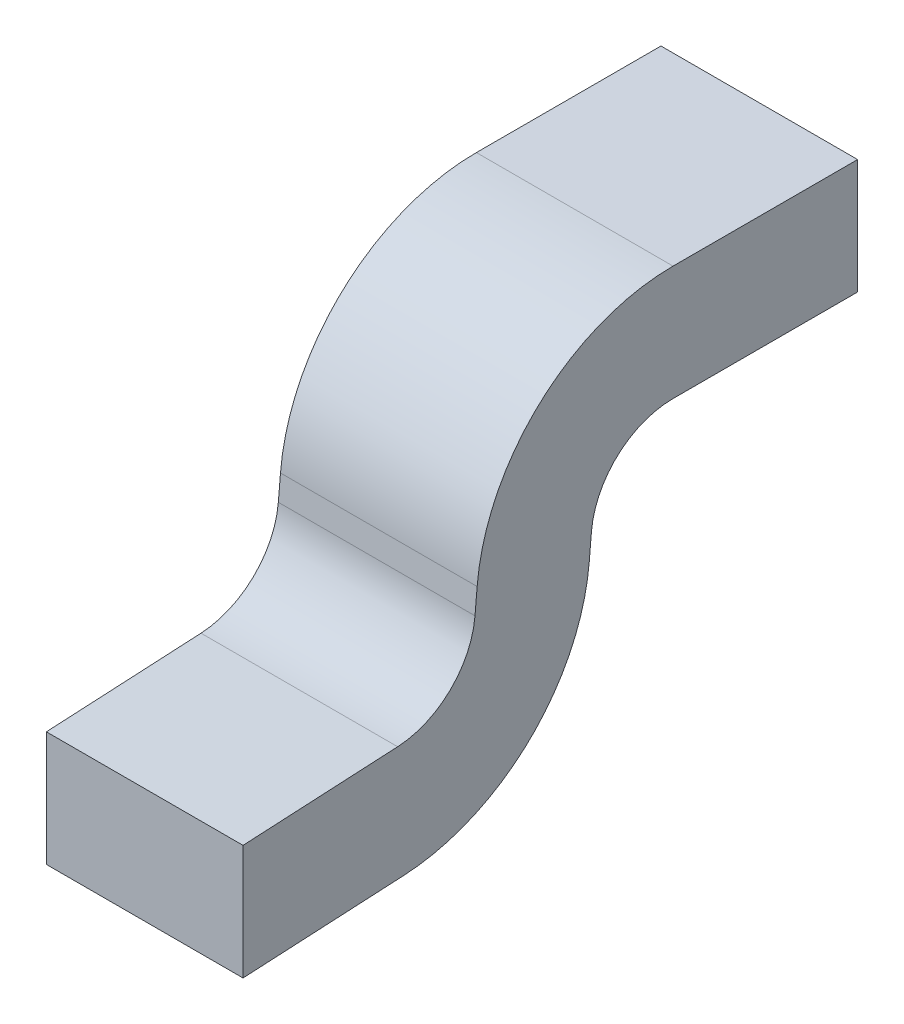
ISO-10303-21;
HEADER;
FILE_DESCRIPTION(('STEP AP214'),'2;1');
FILE_NAME('part.step','',(''),(''),'','','');
FILE_SCHEMA(('AUTOMOTIVE_DESIGN { 1 0 10303 214 1 1 1 1 }'));
ENDSEC;
DATA;
#1=APPLICATION_CONTEXT('core data for automotive mechanical design processes');
#2=APPLICATION_PROTOCOL_DEFINITION('international standard','automotive_design',2000,#1);
#3=PRODUCT_CONTEXT('',#1,'mechanical');
#4=PRODUCT('Part','Part','',(#3));
#5=PRODUCT_RELATED_PRODUCT_CATEGORY('part','',(#4));
#6=PRODUCT_DEFINITION_FORMATION('','',#4);
#7=PRODUCT_DEFINITION_CONTEXT('part definition',#1,'design');
#8=PRODUCT_DEFINITION('design','',#6,#7);
#9=PRODUCT_DEFINITION_SHAPE('','',#8);
#10=(LENGTH_UNIT() NAMED_UNIT(*) SI_UNIT(.MILLI.,.METRE.));
#11=(NAMED_UNIT(*) PLANE_ANGLE_UNIT() SI_UNIT($,.RADIAN.));
#12=(NAMED_UNIT(*) SI_UNIT($,.STERADIAN.) SOLID_ANGLE_UNIT());
#13=UNCERTAINTY_MEASURE_WITH_UNIT(LENGTH_MEASURE(1.E-05),#10,'distance_accuracy_value','');
#14=(GEOMETRIC_REPRESENTATION_CONTEXT(3) GLOBAL_UNCERTAINTY_ASSIGNED_CONTEXT((#13)) GLOBAL_UNIT_ASSIGNED_CONTEXT((#10,
#11,#12)) REPRESENTATION_CONTEXT('',''));
#15=CARTESIAN_POINT('',(0.,0.,0.));
#16=DIRECTION('',(0.,0.,1.));
#17=DIRECTION('',(1.,0.,0.));
#18=AXIS2_PLACEMENT_3D('',#15,#16,#17);
#19=CARTESIAN_POINT('',(0.1524,0.,0.));
#20=DIRECTION('',(1.,0.,0.));
#21=DIRECTION('',(0.,0.,-1.));
#22=AXIS2_PLACEMENT_3D('',#19,#20,#21);
#23=PLANE('',#22);
#24=DIRECTION('',(0.,-0.0523359562429177,0.998629534754575));
#25=VECTOR('',#24,1.);
#26=CARTESIAN_POINT('',(0.1524,-0.05761957494792,0.18352022672));
#27=LINE('',#26,#25);
#28=CARTESIAN_POINT('',(0.1524,-0.0759559968815696,0.5334));
#29=VERTEX_POINT('',#28);
#30=CARTESIAN_POINT('',(0.1524,-0.0633974339373912,0.293768343860575));
#31=VERTEX_POINT('',#30);
#32=EDGE_CURVE('E112',#29,#31,#27,.F.);
#33=ORIENTED_EDGE('',*,*,#32,.F.);
#34=DIRECTION('',(0.,1.,0.));
#35=VECTOR('',#34,1.);
#36=CARTESIAN_POINT('',(0.1524,-0.254,0.5334));
#37=LINE('',#36,#35);
#38=CARTESIAN_POINT('',(0.1524,-0.254,0.5334));
#39=VERTEX_POINT('',#38);
#40=EDGE_CURVE('E103',#29,#39,#37,.F.);
#41=ORIENTED_EDGE('',*,*,#40,.T.);
#42=DIRECTION('',(0.,0.0523359562429177,-0.998629534754575));
#43=VECTOR('',#42,1.);
#44=CARTESIAN_POINT('',(0.1524,-0.254,0.5334));
#45=LINE('',#44,#43);
#46=CARTESIAN_POINT('',(0.1524,-0.240953765216766,0.284463010840585));
#47=VERTEX_POINT('',#46);
#48=EDGE_CURVE('E95',#47,#39,#45,.F.);
#49=ORIENTED_EDGE('',*,*,#48,.F.);
#50=CARTESIAN_POINT('',(0.1524,0.06342851697644,0.300415010303));
#51=DIRECTION('',(-1.,0.,0.));
#52=DIRECTION('',(0.,0.,1.));
#53=AXIS2_PLACEMENT_3D('',#50,#51,#52);
#54=CIRCLE('',#53,0.3048);
#55=CARTESIAN_POINT('',(0.1524,0.0368634465869779,-0.00322513367484743));
#56=VERTEX_POINT('',#55);
#57=EDGE_CURVE('E20',#56,#47,#54,.T.);
#58=ORIENTED_EDGE('',*,*,#57,.F.);
#59=DIRECTION('',(0.,0.996194698091747,-0.0871557427476379));
#60=VECTOR('',#59,1.);
#61=CARTESIAN_POINT('',(0.1524,-0.227086903642,0.01986752970388));
#62=LINE('',#61,#60);
#63=CARTESIAN_POINT('',(0.1524,0.0745687793289503,-0.00652392284429511));
#64=VERTEX_POINT('',#63);
#65=EDGE_CURVE('E149',#64,#56,#62,.F.);
#66=ORIENTED_EDGE('',*,*,#65,.F.);
#67=CARTESIAN_POINT('',(0.1524,0.0635,-0.133040649502));
#68=DIRECTION('',(1.,0.,0.));
#69=DIRECTION('',(0.,0.,-1.));
#70=AXIS2_PLACEMENT_3D('',#67,#68,#69);
#71=CIRCLE('',#70,0.127);
#72=CARTESIAN_POINT('',(0.1524,0.1905,-0.133040649502));
#73=VERTEX_POINT('',#72);
#74=EDGE_CURVE('E146',#64,#73,#71,.F.);
#75=ORIENTED_EDGE('',*,*,#74,.T.);
#76=DIRECTION('',(0.,0.,-1.));
#77=VECTOR('',#76,1.);
#78=CARTESIAN_POINT('',(0.1524,0.1905,-0.01666659040169));
#79=LINE('',#78,#77);
#80=CARTESIAN_POINT('',(0.1524,0.1905,-0.4191));
#81=VERTEX_POINT('',#80);
#82=EDGE_CURVE('E144',#81,#73,#79,.F.);
#83=ORIENTED_EDGE('',*,*,#82,.F.);
#84=DIRECTION('',(0.,1.,0.));
#85=VECTOR('',#84,1.);
#86=CARTESIAN_POINT('',(0.1524,0.1905,-0.4191));
#87=LINE('',#86,#85);
#88=CARTESIAN_POINT('',(0.1524,0.3683,-0.4191));
#89=VERTEX_POINT('',#88);
#90=EDGE_CURVE('E138',#89,#81,#87,.F.);
#91=ORIENTED_EDGE('',*,*,#90,.F.);
#92=DIRECTION('',(0.,0.,1.));
#93=VECTOR('',#92,1.);
#94=CARTESIAN_POINT('',(0.1524,0.3683,-0.4191));
#95=LINE('',#94,#93);
#96=CARTESIAN_POINT('',(0.1524,0.3683,-0.133040649502));
#97=VERTEX_POINT('',#96);
#98=EDGE_CURVE('E131',#97,#89,#95,.F.);
#99=ORIENTED_EDGE('',*,*,#98,.F.);
#100=CARTESIAN_POINT('',(0.1524,0.0635,-0.133040649502));
#101=DIRECTION('',(-1.,0.,0.));
#102=DIRECTION('',(0.,0.,1.));
#103=AXIS2_PLACEMENT_3D('',#100,#101,#102);
#104=CIRCLE('',#103,0.3048);
#105=CARTESIAN_POINT('',(0.1524,0.0900650703895345,0.170599494476747));
#106=VERTEX_POINT('',#105);
#107=EDGE_CURVE('E172',#106,#97,#104,.T.);
#108=ORIENTED_EDGE('',*,*,#107,.F.);
#109=DIRECTION('',(0.,-0.996194698091747,0.0871557427476379));
#110=VECTOR('',#109,1.);
#111=CARTESIAN_POINT('',(0.1524,0.01549629106053,0.177123417321));
#112=LINE('',#111,#110);
#113=CARTESIAN_POINT('',(0.1524,0.0523597376475014,0.173898283645747));
#114=VERTEX_POINT('',#113);
#115=EDGE_CURVE('E127',#114,#106,#112,.F.);
#116=ORIENTED_EDGE('',*,*,#115,.F.);
#117=CARTESIAN_POINT('',(0.1524,0.06342851697644,0.300415010303));
#118=DIRECTION('',(1.,0.,0.));
#119=DIRECTION('',(0.,0.,-1.));
#120=AXIS2_PLACEMENT_3D('',#117,#118,#119);
#121=CIRCLE('',#120,0.127);
#122=EDGE_CURVE('E117',#114,#31,#121,.F.);
#123=ORIENTED_EDGE('',*,*,#122,.T.);
#124=EDGE_LOOP('',(#33,#41,#49,#58,#66,#75,#83,#91,#99,#108,#116,#123));
#125=FACE_BOUND('',#124,.T.);
#126=ADVANCED_FACE('F17',(#125),#23,.T.);
#127=CARTESIAN_POINT('',(0.18288,-0.254,0.5334));
#128=DIRECTION('',(0.,0.,-1.));
#129=DIRECTION('',(-1.,0.,0.));
#130=AXIS2_PLACEMENT_3D('',#127,#128,#129);
#131=PLANE('',#130);
#132=ORIENTED_EDGE('',*,*,#40,.F.);
#133=DIRECTION('',(1.,0.,0.));
#134=VECTOR('',#133,1.);
#135=CARTESIAN_POINT('',(-0.1524,-0.0759559968815696,0.533400000000001));
#136=LINE('',#135,#134);
#137=CARTESIAN_POINT('',(-0.1524,-0.0759559968815765,0.5334));
#138=VERTEX_POINT('',#137);
#139=EDGE_CURVE('E107',#138,#29,#136,.T.);
#140=ORIENTED_EDGE('',*,*,#139,.F.);
#141=DIRECTION('',(0.,1.,0.));
#142=VECTOR('',#141,1.);
#143=CARTESIAN_POINT('',(-0.1524,0.,0.5334));
#144=LINE('',#143,#142);
#145=CARTESIAN_POINT('',(-0.1524,-0.254,0.5334));
#146=VERTEX_POINT('',#145);
#147=EDGE_CURVE('E114',#138,#146,#144,.F.);
#148=ORIENTED_EDGE('',*,*,#147,.T.);
#149=DIRECTION('',(1.,0.,0.));
#150=VECTOR('',#149,1.);
#151=CARTESIAN_POINT('',(-0.1524,-0.254,0.5334));
#152=LINE('',#151,#150);
#153=EDGE_CURVE('E108',#39,#146,#152,.F.);
#154=ORIENTED_EDGE('',*,*,#153,.F.);
#155=EDGE_LOOP('',(#132,#140,#148,#154));
#156=FACE_BOUND('',#155,.T.);
#157=ADVANCED_FACE('F105',(#156),#131,.F.);
#158=CARTESIAN_POINT('',(-0.1524,-0.254,0.5334));
#159=DIRECTION('',(0.,-0.998629534754575,-0.0523359562429177));
#160=DIRECTION('',(0.,0.0523359562429177,-0.998629534754575));
#161=AXIS2_PLACEMENT_3D('',#158,#159,#160);
#162=PLANE('',#161);
#163=ORIENTED_EDGE('',*,*,#48,.T.);
#164=ORIENTED_EDGE('',*,*,#153,.T.);
#165=DIRECTION('',(0.,0.0523359562420249,-0.998629534754622));
#166=VECTOR('',#165,1.);
#167=CARTESIAN_POINT('',(-0.1524,-0.254,0.5334));
#168=LINE('',#167,#166);
#169=CARTESIAN_POINT('',(-0.1524,-0.240953765216884,0.284463010840715));
#170=VERTEX_POINT('',#169);
#171=EDGE_CURVE('E170',#146,#170,#168,.T.);
#172=ORIENTED_EDGE('',*,*,#171,.T.);
#173=DIRECTION('',(-1.,0.,0.));
#174=VECTOR('',#173,1.);
#175=CARTESIAN_POINT('',(-0.1524,-0.240953765216799,0.284463010841011));
#176=LINE('',#175,#174);
#177=EDGE_CURVE('E185',#47,#170,#176,.T.);
#178=ORIENTED_EDGE('',*,*,#177,.F.);
#179=EDGE_LOOP('',(#163,#164,#172,#178));
#180=FACE_BOUND('',#179,.T.);
#181=ADVANCED_FACE('F191',(#180),#162,.T.);
#182=CARTESIAN_POINT('',(-0.1524,0.06342851697644,0.300415010303));
#183=DIRECTION('',(-1.,0.,0.));
#184=DIRECTION('',(0.,0.,1.));
#185=AXIS2_PLACEMENT_3D('',#182,#183,#184);
#186=CYLINDRICAL_SURFACE('',#185,0.3048);
#187=CARTESIAN_POINT('',(-0.1524,0.06342851697644,0.300415010303));
#188=DIRECTION('',(-1.,0.,0.));
#189=DIRECTION('',(0.,0.,1.));
#190=AXIS2_PLACEMENT_3D('',#187,#188,#189);
#191=CIRCLE('',#190,0.3048);
#192=CARTESIAN_POINT('',(-0.1524,0.0368634465869818,-0.0032251336748518));
#193=VERTEX_POINT('',#192);
#194=EDGE_CURVE('E168',#170,#193,#191,.F.);
#195=ORIENTED_EDGE('',*,*,#194,.T.);
#196=DIRECTION('',(1.,0.,0.));
#197=VECTOR('',#196,1.);
#198=CARTESIAN_POINT('',(-0.1524,0.0368634465869507,-0.00322513367484505));
#199=LINE('',#198,#197);
#200=EDGE_CURVE('E152',#56,#193,#199,.F.);
#201=ORIENTED_EDGE('',*,*,#200,.F.);
#202=ORIENTED_EDGE('',*,*,#57,.T.);
#203=ORIENTED_EDGE('',*,*,#177,.T.);
#204=EDGE_LOOP('',(#195,#201,#202,#203));
#205=FACE_BOUND('',#204,.T.);
#206=ADVANCED_FACE('F245',(#205),#186,.T.);
#207=CARTESIAN_POINT('',(-0.1524,-0.227086903642,0.01986752970388));
#208=DIRECTION('',(0.,-0.0871557427476379,-0.996194698091747));
#209=DIRECTION('',(0.,0.996194698091747,-0.0871557427476379));
#210=AXIS2_PLACEMENT_3D('',#207,#208,#209);
#211=PLANE('',#210);
#212=DIRECTION('',(1.,0.,0.));
#213=VECTOR('',#212,1.);
#214=CARTESIAN_POINT('',(-0.1524,0.0745687793289414,-0.00652392284434736));
#215=LINE('',#214,#213);
#216=CARTESIAN_POINT('',(-0.1524,0.0745687793289482,-0.00652392284429839));
#217=VERTEX_POINT('',#216);
#218=EDGE_CURVE('E151',#217,#64,#215,.T.);
#219=ORIENTED_EDGE('',*,*,#218,.T.);
#220=ORIENTED_EDGE('',*,*,#65,.T.);
#221=ORIENTED_EDGE('',*,*,#200,.T.);
#222=DIRECTION('',(0.,0.99619469809175,-0.0871557427476098));
#223=VECTOR('',#222,1.);
#224=CARTESIAN_POINT('',(-0.1524,0.03686344658695,-0.003225133674853));
#225=LINE('',#224,#223);
#226=EDGE_CURVE('E167',#193,#217,#225,.T.);
#227=ORIENTED_EDGE('',*,*,#226,.T.);
#228=EDGE_LOOP('',(#219,#220,#221,#227));
#229=FACE_BOUND('',#228,.T.);
#230=ADVANCED_FACE('F244',(#229),#211,.T.);
#231=CARTESIAN_POINT('',(-0.1524,0.0635,-0.133040649502));
#232=DIRECTION('',(1.,0.,0.));
#233=DIRECTION('',(0.,0.,-1.));
#234=AXIS2_PLACEMENT_3D('',#231,#232,#233);
#235=CYLINDRICAL_SURFACE('',#234,0.127);
#236=ORIENTED_EDGE('',*,*,#218,.F.);
#237=CARTESIAN_POINT('',(-0.1524,0.0635,-0.133040649502));
#238=DIRECTION('',(1.,0.,0.));
#239=DIRECTION('',(0.,0.,-1.));
#240=AXIS2_PLACEMENT_3D('',#237,#238,#239);
#241=CIRCLE('',#240,0.127);
#242=CARTESIAN_POINT('',(-0.1524,0.1905,-0.133040649502));
#243=VERTEX_POINT('',#242);
#244=EDGE_CURVE('E163',#217,#243,#241,.F.);
#245=ORIENTED_EDGE('',*,*,#244,.T.);
#246=DIRECTION('',(1.,0.,0.));
#247=VECTOR('',#246,1.);
#248=CARTESIAN_POINT('',(-0.1524,0.1905,-0.133040649502));
#249=LINE('',#248,#247);
#250=EDGE_CURVE('E141',#73,#243,#249,.F.);
#251=ORIENTED_EDGE('',*,*,#250,.F.);
#252=ORIENTED_EDGE('',*,*,#74,.F.);
#253=EDGE_LOOP('',(#236,#245,#251,#252));
#254=FACE_BOUND('',#253,.T.);
#255=ADVANCED_FACE('F253',(#254),#235,.F.);
#256=CARTESIAN_POINT('',(-0.1524,0.1905,-0.01666659040169));
#257=DIRECTION('',(0.,-1.,0.));
#258=DIRECTION('',(0.,0.,-1.));
#259=AXIS2_PLACEMENT_3D('',#256,#257,#258);
#260=PLANE('',#259);
#261=ORIENTED_EDGE('',*,*,#250,.T.);
#262=DIRECTION('',(0.,0.,-1.));
#263=VECTOR('',#262,1.);
#264=CARTESIAN_POINT('',(-0.1524,0.1905,0.));
#265=LINE('',#264,#263);
#266=CARTESIAN_POINT('',(-0.1524,0.1905,-0.4191));
#267=VERTEX_POINT('',#266);
#268=EDGE_CURVE('E166',#243,#267,#265,.T.);
#269=ORIENTED_EDGE('',*,*,#268,.T.);
#270=DIRECTION('',(-1.,0.,0.));
#271=VECTOR('',#270,1.);
#272=CARTESIAN_POINT('',(-0.1524,0.1905,-0.4191));
#273=LINE('',#272,#271);
#274=EDGE_CURVE('E135',#81,#267,#273,.T.);
#275=ORIENTED_EDGE('',*,*,#274,.F.);
#276=ORIENTED_EDGE('',*,*,#82,.T.);
#277=EDGE_LOOP('',(#261,#269,#275,#276));
#278=FACE_BOUND('',#277,.T.);
#279=ADVANCED_FACE('F234',(#278),#260,.T.);
#280=CARTESIAN_POINT('',(-0.1524,0.1905,-0.4191));
#281=DIRECTION('',(0.,0.,-1.));
#282=DIRECTION('',(-1.,0.,0.));
#283=AXIS2_PLACEMENT_3D('',#280,#281,#282);
#284=PLANE('',#283);
#285=ORIENTED_EDGE('',*,*,#274,.T.);
#286=DIRECTION('',(0.,1.,0.));
#287=VECTOR('',#286,1.);
#288=CARTESIAN_POINT('',(-0.1524,0.,-0.4191));
#289=LINE('',#288,#287);
#290=CARTESIAN_POINT('',(-0.1524,0.3683,-0.4191));
#291=VERTEX_POINT('',#290);
#292=EDGE_CURVE('E213',#267,#291,#289,.T.);
#293=ORIENTED_EDGE('',*,*,#292,.T.);
#294=DIRECTION('',(1.,0.,0.));
#295=VECTOR('',#294,1.);
#296=CARTESIAN_POINT('',(-0.1524,0.3683,-0.4191));
#297=LINE('',#296,#295);
#298=EDGE_CURVE('E134',#89,#291,#297,.F.);
#299=ORIENTED_EDGE('',*,*,#298,.F.);
#300=ORIENTED_EDGE('',*,*,#90,.T.);
#301=EDGE_LOOP('',(#285,#293,#299,#300));
#302=FACE_BOUND('',#301,.T.);
#303=ADVANCED_FACE('F223',(#302),#284,.T.);
#304=CARTESIAN_POINT('',(-0.1524,0.3683,-0.4191));
#305=DIRECTION('',(0.,1.,0.));
#306=DIRECTION('',(0.,0.,1.));
#307=AXIS2_PLACEMENT_3D('',#304,#305,#306);
#308=PLANE('',#307);
#309=ORIENTED_EDGE('',*,*,#298,.T.);
#310=DIRECTION('',(0.,0.,-1.));
#311=VECTOR('',#310,1.);
#312=CARTESIAN_POINT('',(-0.1524,0.3683,0.));
#313=LINE('',#312,#311);
#314=CARTESIAN_POINT('',(-0.1524,0.3683,-0.133040649502));
#315=VERTEX_POINT('',#314);
#316=EDGE_CURVE('E162',#291,#315,#313,.F.);
#317=ORIENTED_EDGE('',*,*,#316,.T.);
#318=DIRECTION('',(-1.,0.,0.));
#319=VECTOR('',#318,1.);
#320=CARTESIAN_POINT('',(-0.1524,0.3683,-0.133040649502));
#321=LINE('',#320,#319);
#322=EDGE_CURVE('E130',#97,#315,#321,.T.);
#323=ORIENTED_EDGE('',*,*,#322,.F.);
#324=ORIENTED_EDGE('',*,*,#98,.T.);
#325=EDGE_LOOP('',(#309,#317,#323,#324));
#326=FACE_BOUND('',#325,.T.);
#327=ADVANCED_FACE('F274',(#326),#308,.T.);
#328=CARTESIAN_POINT('',(-0.1524,0.0635,-0.133040649502));
#329=DIRECTION('',(-1.,0.,0.));
#330=DIRECTION('',(0.,0.,1.));
#331=AXIS2_PLACEMENT_3D('',#328,#329,#330);
#332=CYLINDRICAL_SURFACE('',#331,0.3048);
#333=CARTESIAN_POINT('',(-0.1524,0.0635,-0.133040649502));
#334=DIRECTION('',(-1.,0.,0.));
#335=DIRECTION('',(0.,0.,1.));
#336=AXIS2_PLACEMENT_3D('',#333,#334,#335);
#337=CIRCLE('',#336,0.3048);
#338=CARTESIAN_POINT('',(-0.1524,0.0900650703919145,0.170599494476164));
#339=VERTEX_POINT('',#338);
#340=EDGE_CURVE('E159',#315,#339,#337,.F.);
#341=ORIENTED_EDGE('',*,*,#340,.T.);
#342=DIRECTION('',(1.,0.,0.));
#343=VECTOR('',#342,1.);
#344=CARTESIAN_POINT('',(-0.1524,0.0900650703895552,0.170599494476746));
#345=LINE('',#344,#343);
#346=EDGE_CURVE('E129',#106,#339,#345,.F.);
#347=ORIENTED_EDGE('',*,*,#346,.F.);
#348=ORIENTED_EDGE('',*,*,#107,.T.);
#349=ORIENTED_EDGE('',*,*,#322,.T.);
#350=EDGE_LOOP('',(#341,#347,#348,#349));
#351=FACE_BOUND('',#350,.T.);
#352=ADVANCED_FACE('F270',(#351),#332,.T.);
#353=CARTESIAN_POINT('',(-0.1524,0.01549629106053,0.177123417321));
#354=DIRECTION('',(0.,0.0871557427476379,0.996194698091747));
#355=DIRECTION('',(0.,-0.996194698091747,0.0871557427476379));
#356=AXIS2_PLACEMENT_3D('',#353,#354,#355);
#357=PLANE('',#356);
#358=ORIENTED_EDGE('',*,*,#346,.T.);
#359=DIRECTION('',(0.,-0.996194698090362,0.0871557427634692));
#360=VECTOR('',#359,1.);
#361=CARTESIAN_POINT('',(-0.1524,0.09006507038949,0.170599494476));
#362=LINE('',#361,#360);
#363=CARTESIAN_POINT('',(-0.1524,0.0523597376464897,0.173898283645762));
#364=VERTEX_POINT('',#363);
#365=EDGE_CURVE('E158',#339,#364,#362,.T.);
#366=ORIENTED_EDGE('',*,*,#365,.T.);
#367=DIRECTION('',(1.,0.,0.));
#368=VECTOR('',#367,1.);
#369=CARTESIAN_POINT('',(-0.1524,0.0523597376474434,0.173898283645352));
#370=LINE('',#369,#368);
#371=EDGE_CURVE('E120',#364,#114,#370,.T.);
#372=ORIENTED_EDGE('',*,*,#371,.T.);
#373=ORIENTED_EDGE('',*,*,#115,.T.);
#374=EDGE_LOOP('',(#358,#366,#372,#373));
#375=FACE_BOUND('',#374,.T.);
#376=ADVANCED_FACE('F266',(#375),#357,.T.);
#377=CARTESIAN_POINT('',(-0.1524,0.06342851697644,0.300415010303));
#378=DIRECTION('',(1.,0.,0.));
#379=DIRECTION('',(0.,0.,-1.));
#380=AXIS2_PLACEMENT_3D('',#377,#378,#379);
#381=CYLINDRICAL_SURFACE('',#380,0.127);
#382=ORIENTED_EDGE('',*,*,#371,.F.);
#383=CARTESIAN_POINT('',(-0.1524,0.06342851697644,0.300415010303));
#384=DIRECTION('',(1.,0.,0.));
#385=DIRECTION('',(0.,0.,-1.));
#386=AXIS2_PLACEMENT_3D('',#383,#384,#385);
#387=CIRCLE('',#386,0.127);
#388=CARTESIAN_POINT('',(-0.1524,-0.063397433937379,0.293768343860566));
#389=VERTEX_POINT('',#388);
#390=EDGE_CURVE('E26',#364,#389,#387,.F.);
#391=ORIENTED_EDGE('',*,*,#390,.T.);
#392=DIRECTION('',(1.,0.,0.));
#393=VECTOR('',#392,1.);
#394=CARTESIAN_POINT('',(-0.1524,-0.0633974339374134,0.293768343860999));
#395=LINE('',#394,#393);
#396=EDGE_CURVE('E34',#31,#389,#395,.F.);
#397=ORIENTED_EDGE('',*,*,#396,.F.);
#398=ORIENTED_EDGE('',*,*,#122,.F.);
#399=EDGE_LOOP('',(#382,#391,#397,#398));
#400=FACE_BOUND('',#399,.T.);
#401=ADVANCED_FACE('F261',(#400),#381,.F.);
#402=CARTESIAN_POINT('',(-0.1524,-0.05761957494792,0.18352022672));
#403=DIRECTION('',(0.,0.998629534754575,0.0523359562429177));
#404=DIRECTION('',(0.,-0.0523359562429177,0.998629534754575));
#405=AXIS2_PLACEMENT_3D('',#402,#403,#404);
#406=PLANE('',#405);
#407=DIRECTION('',(0.,-0.0523359562430588,0.998629534754568));
#408=VECTOR('',#407,1.);
#409=CARTESIAN_POINT('',(-0.1524,-0.06339743393739,0.293768343861));
#410=LINE('',#409,#408);
#411=EDGE_CURVE('E11',#389,#138,#410,.T.);
#412=ORIENTED_EDGE('',*,*,#411,.T.);
#413=ORIENTED_EDGE('',*,*,#139,.T.);
#414=ORIENTED_EDGE('',*,*,#32,.T.);
#415=ORIENTED_EDGE('',*,*,#396,.T.);
#416=EDGE_LOOP('',(#412,#413,#414,#415));
#417=FACE_BOUND('',#416,.T.);
#418=ADVANCED_FACE('F111',(#417),#406,.T.);
#419=CARTESIAN_POINT('',(-0.1524,0.,0.));
#420=DIRECTION('',(1.,0.,0.));
#421=DIRECTION('',(0.,0.,-1.));
#422=AXIS2_PLACEMENT_3D('',#419,#420,#421);
#423=PLANE('',#422);
#424=ORIENTED_EDGE('',*,*,#390,.F.);
#425=ORIENTED_EDGE('',*,*,#365,.F.);
#426=ORIENTED_EDGE('',*,*,#340,.F.);
#427=ORIENTED_EDGE('',*,*,#316,.F.);
#428=ORIENTED_EDGE('',*,*,#292,.F.);
#429=ORIENTED_EDGE('',*,*,#268,.F.);
#430=ORIENTED_EDGE('',*,*,#244,.F.);
#431=ORIENTED_EDGE('',*,*,#226,.F.);
#432=ORIENTED_EDGE('',*,*,#194,.F.);
#433=ORIENTED_EDGE('',*,*,#171,.F.);
#434=ORIENTED_EDGE('',*,*,#147,.F.);
#435=ORIENTED_EDGE('',*,*,#411,.F.);
#436=EDGE_LOOP('',(#424,#425,#426,#427,#428,#429,#430,#431,#432,#433,#434,#435));
#437=FACE_BOUND('',#436,.T.);
#438=ADVANCED_FACE('F196',(#437),#423,.F.);
#439=CLOSED_SHELL('',(#126,#157,#181,#206,#230,#255,#279,#303,#327,#352,#376,#401,#418,#438));
#440=MANIFOLD_SOLID_BREP('B1',#439);
#441=ADVANCED_BREP_SHAPE_REPRESENTATION('',(#18,#440),#14);
#442=SHAPE_DEFINITION_REPRESENTATION(#9,#441);
ENDSEC;
END-ISO-10303-21;
